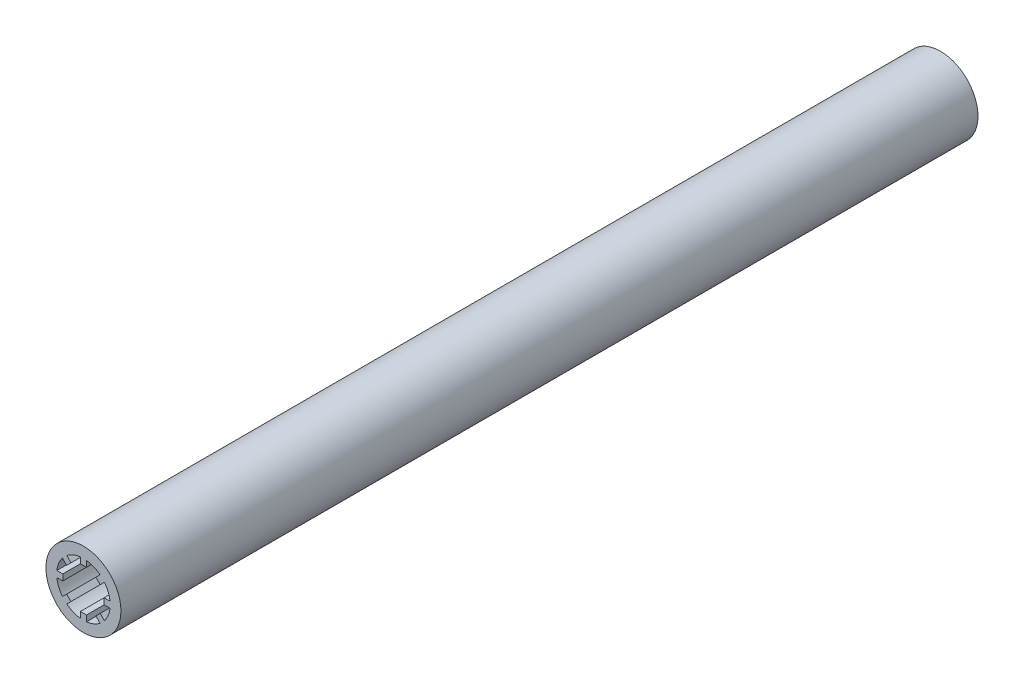
ISO-10303-21;
HEADER;
FILE_DESCRIPTION(('STEP AP214'),'2;1');
FILE_NAME('part.step','',(''),(''),'','','');
FILE_SCHEMA(('AUTOMOTIVE_DESIGN { 1 0 10303 214 1 1 1 1 }'));
ENDSEC;
DATA;
#1=APPLICATION_CONTEXT('core data for automotive mechanical design processes');
#2=APPLICATION_PROTOCOL_DEFINITION('international standard','automotive_design',2000,#1);
#3=PRODUCT_CONTEXT('',#1,'mechanical');
#4=PRODUCT('Part','Part','',(#3));
#5=PRODUCT_RELATED_PRODUCT_CATEGORY('part','',(#4));
#6=PRODUCT_DEFINITION_FORMATION('','',#4);
#7=PRODUCT_DEFINITION_CONTEXT('part definition',#1,'design');
#8=PRODUCT_DEFINITION('design','',#6,#7);
#9=PRODUCT_DEFINITION_SHAPE('','',#8);
#10=(LENGTH_UNIT() NAMED_UNIT(*) SI_UNIT(.MILLI.,.METRE.));
#11=(NAMED_UNIT(*) PLANE_ANGLE_UNIT() SI_UNIT($,.RADIAN.));
#12=(NAMED_UNIT(*) SI_UNIT($,.STERADIAN.) SOLID_ANGLE_UNIT());
#13=UNCERTAINTY_MEASURE_WITH_UNIT(LENGTH_MEASURE(1.E-05),#10,'distance_accuracy_value','');
#14=(GEOMETRIC_REPRESENTATION_CONTEXT(3) GLOBAL_UNCERTAINTY_ASSIGNED_CONTEXT((#13)) GLOBAL_UNIT_ASSIGNED_CONTEXT((#10,
#11,#12)) REPRESENTATION_CONTEXT('',''));
#15=CARTESIAN_POINT('',(0.,0.,0.));
#16=DIRECTION('',(0.,0.,1.));
#17=DIRECTION('',(1.,0.,0.));
#18=AXIS2_PLACEMENT_3D('',#15,#16,#17);
#19=CARTESIAN_POINT('',(0.,0.,280.));
#20=DIRECTION('',(0.,0.,-1.));
#21=DIRECTION('',(-1.,0.,0.));
#22=AXIS2_PLACEMENT_3D('',#19,#20,#21);
#23=CYLINDRICAL_SURFACE('',#22,12.25);
#24=CARTESIAN_POINT('',(0.,0.,280.));
#25=DIRECTION('',(0.,0.,1.));
#26=DIRECTION('',(1.,0.,0.));
#27=AXIS2_PLACEMENT_3D('',#24,#25,#26);
#28=CIRCLE('',#27,12.25);
#29=CARTESIAN_POINT('',(12.25,0.,280.));
#30=VERTEX_POINT('',#29);
#31=EDGE_CURVE('E11',#30,#30,#28,.T.);
#32=ORIENTED_EDGE('',*,*,#31,.F.);
#33=EDGE_LOOP('',(#32));
#34=FACE_BOUND('',#33,.T.);
#35=CARTESIAN_POINT('',(0.,0.,0.));
#36=DIRECTION('',(0.,0.,1.));
#37=DIRECTION('',(1.,0.,0.));
#38=AXIS2_PLACEMENT_3D('',#35,#36,#37);
#39=CIRCLE('',#38,12.25);
#40=CARTESIAN_POINT('',(12.25,0.,0.));
#41=VERTEX_POINT('',#40);
#42=EDGE_CURVE('E36',#41,#41,#39,.T.);
#43=ORIENTED_EDGE('',*,*,#42,.T.);
#44=EDGE_LOOP('',(#43));
#45=FACE_BOUND('',#44,.T.);
#46=ADVANCED_FACE('F33',(#34,#45),#23,.T.);
#47=CARTESIAN_POINT('',(0.,0.,280.));
#48=DIRECTION('',(0.,0.,1.));
#49=DIRECTION('',(1.,0.,0.));
#50=AXIS2_PLACEMENT_3D('',#47,#48,#49);
#51=PLANE('',#50);
#52=DIRECTION('',(0.,-1.,0.));
#53=VECTOR('',#52,1.);
#54=CARTESIAN_POINT('',(1.,8.69266932535686,280.));
#55=LINE('',#54,#53);
#56=CARTESIAN_POINT('',(0.999999999999999,8.69266932535686,280.));
#57=VERTEX_POINT('',#56);
#58=CARTESIAN_POINT('',(1.,6.75000000000049,280.));
#59=VERTEX_POINT('',#58);
#60=EDGE_CURVE('E47',#57,#59,#55,.T.);
#61=ORIENTED_EDGE('',*,*,#60,.F.);
#62=CARTESIAN_POINT('',(0.,0.,280.));
#63=DIRECTION('',(0.,0.,1.));
#64=DIRECTION('',(1.,0.,0.));
#65=AXIS2_PLACEMENT_3D('',#62,#63,#64);
#66=CIRCLE('',#65,8.75);
#67=CARTESIAN_POINT('',(5.43953864538541,6.8537522077588,280.));
#68=VERTEX_POINT('',#67);
#69=EDGE_CURVE('E364',#68,#57,#66,.T.);
#70=ORIENTED_EDGE('',*,*,#69,.F.);
#71=DIRECTION('',(0.707106781186547,0.707106781186548,0.));
#72=VECTOR('',#71,1.);
#73=CARTESIAN_POINT('',(5.43953864538541,6.8537522077588,280.));
#74=LINE('',#73,#72);
#75=CARTESIAN_POINT('',(4.06586399182281,5.48007755419621,280.));
#76=VERTEX_POINT('',#75);
#77=EDGE_CURVE('E362',#76,#68,#74,.T.);
#78=ORIENTED_EDGE('',*,*,#77,.F.);
#79=DIRECTION('',(-0.707106781186547,0.707106781186548,0.));
#80=VECTOR('',#79,1.);
#81=CARTESIAN_POINT('',(5.48007755419606,4.06586399182296,280.));
#82=LINE('',#81,#80);
#83=CARTESIAN_POINT('',(5.48007755419606,4.06586399182296,280.));
#84=VERTEX_POINT('',#83);
#85=EDGE_CURVE('E251',#84,#76,#82,.T.);
#86=ORIENTED_EDGE('',*,*,#85,.F.);
#87=DIRECTION('',(-0.707106781186546,-0.707106781186549,0.));
#88=VECTOR('',#87,1.);
#89=CARTESIAN_POINT('',(6.85375220775867,5.43953864538558,280.));
#90=LINE('',#89,#88);
#91=CARTESIAN_POINT('',(6.85375220775867,5.43953864538558,280.));
#92=VERTEX_POINT('',#91);
#93=EDGE_CURVE('E358',#92,#84,#90,.T.);
#94=ORIENTED_EDGE('',*,*,#93,.F.);
#95=CARTESIAN_POINT('',(0.,0.,280.));
#96=DIRECTION('',(0.,0.,1.));
#97=DIRECTION('',(1.,0.,0.));
#98=AXIS2_PLACEMENT_3D('',#95,#96,#97);
#99=CIRCLE('',#98,8.75);
#100=CARTESIAN_POINT('',(8.69266932535683,1.00000000000021,280.));
#101=VERTEX_POINT('',#100);
#102=EDGE_CURVE('E355',#101,#92,#99,.T.);
#103=ORIENTED_EDGE('',*,*,#102,.F.);
#104=DIRECTION('',(1.,0.,0.));
#105=VECTOR('',#104,1.);
#106=CARTESIAN_POINT('',(8.69266932535683,1.00000000000021,280.));
#107=LINE('',#106,#105);
#108=CARTESIAN_POINT('',(6.75000000000044,1.00000000000021,280.));
#109=VERTEX_POINT('',#108);
#110=EDGE_CURVE('E352',#109,#101,#107,.T.);
#111=ORIENTED_EDGE('',*,*,#110,.F.);
#112=DIRECTION('',(0.,1.,0.));
#113=VECTOR('',#112,1.);
#114=CARTESIAN_POINT('',(6.75000000000044,-1.,280.));
#115=LINE('',#114,#113);
#116=CARTESIAN_POINT('',(6.75000000000044,-1.,280.));
#117=VERTEX_POINT('',#116);
#118=EDGE_CURVE('E349',#117,#109,#115,.T.);
#119=ORIENTED_EDGE('',*,*,#118,.F.);
#120=DIRECTION('',(-1.,0.,0.));
#121=VECTOR('',#120,1.);
#122=CARTESIAN_POINT('',(8.69266932535686,-0.999999999999999,280.));
#123=LINE('',#122,#121);
#124=CARTESIAN_POINT('',(8.69266932535686,-1.,280.));
#125=VERTEX_POINT('',#124);
#126=EDGE_CURVE('E346',#125,#117,#123,.T.);
#127=ORIENTED_EDGE('',*,*,#126,.F.);
#128=CARTESIAN_POINT('',(0.,0.,280.));
#129=DIRECTION('',(0.,0.,1.));
#130=DIRECTION('',(1.,0.,0.));
#131=AXIS2_PLACEMENT_3D('',#128,#129,#130);
#132=CIRCLE('',#131,8.75);
#133=CARTESIAN_POINT('',(6.85375220775881,-5.43953864538541,280.));
#134=VERTEX_POINT('',#133);
#135=EDGE_CURVE('E343',#134,#125,#132,.T.);
#136=ORIENTED_EDGE('',*,*,#135,.F.);
#137=DIRECTION('',(0.707106781186548,-0.707106781186547,0.));
#138=VECTOR('',#137,1.);
#139=CARTESIAN_POINT('',(6.85375220775881,-5.43953864538541,280.));
#140=LINE('',#139,#138);
#141=CARTESIAN_POINT('',(5.48007755419621,-4.06586399182281,280.));
#142=VERTEX_POINT('',#141);
#143=EDGE_CURVE('E340',#142,#134,#140,.T.);
#144=ORIENTED_EDGE('',*,*,#143,.F.);
#145=DIRECTION('',(0.707106781186548,0.707106781186548,0.));
#146=VECTOR('',#145,1.);
#147=CARTESIAN_POINT('',(4.06586399182296,-5.48007755419606,280.));
#148=LINE('',#147,#146);
#149=CARTESIAN_POINT('',(4.06586399182296,-5.48007755419606,280.));
#150=VERTEX_POINT('',#149);
#151=EDGE_CURVE('E337',#150,#142,#148,.T.);
#152=ORIENTED_EDGE('',*,*,#151,.F.);
#153=DIRECTION('',(-0.707106781186549,0.707106781186546,0.));
#154=VECTOR('',#153,1.);
#155=CARTESIAN_POINT('',(5.43953864538558,-6.85375220775867,280.));
#156=LINE('',#155,#154);
#157=CARTESIAN_POINT('',(5.43953864538557,-6.85375220775867,280.));
#158=VERTEX_POINT('',#157);
#159=EDGE_CURVE('E334',#158,#150,#156,.T.);
#160=ORIENTED_EDGE('',*,*,#159,.F.);
#161=CARTESIAN_POINT('',(0.,0.,280.));
#162=DIRECTION('',(0.,0.,1.));
#163=DIRECTION('',(1.,0.,0.));
#164=AXIS2_PLACEMENT_3D('',#161,#162,#163);
#165=CIRCLE('',#164,8.75);
#166=CARTESIAN_POINT('',(1.00000000000021,-8.69266932535683,280.));
#167=VERTEX_POINT('',#166);
#168=EDGE_CURVE('E331',#167,#158,#165,.T.);
#169=ORIENTED_EDGE('',*,*,#168,.F.);
#170=DIRECTION('',(0.,-1.,0.));
#171=VECTOR('',#170,1.);
#172=CARTESIAN_POINT('',(1.00000000000021,-8.69266932535683,280.));
#173=LINE('',#172,#171);
#174=CARTESIAN_POINT('',(1.00000000000021,-6.75000000000044,280.));
#175=VERTEX_POINT('',#174);
#176=EDGE_CURVE('E328',#175,#167,#173,.T.);
#177=ORIENTED_EDGE('',*,*,#176,.F.);
#178=DIRECTION('',(1.,0.,0.));
#179=VECTOR('',#178,1.);
#180=CARTESIAN_POINT('',(-1.,-6.75000000000044,280.));
#181=LINE('',#180,#179);
#182=CARTESIAN_POINT('',(-1.,-6.75000000000044,280.));
#183=VERTEX_POINT('',#182);
#184=EDGE_CURVE('E325',#183,#175,#181,.T.);
#185=ORIENTED_EDGE('',*,*,#184,.F.);
#186=DIRECTION('',(0.,1.,0.));
#187=VECTOR('',#186,1.);
#188=CARTESIAN_POINT('',(-0.999999999999999,-8.69266932535686,280.));
#189=LINE('',#188,#187);
#190=CARTESIAN_POINT('',(-1.,-8.69266932535686,280.));
#191=VERTEX_POINT('',#190);
#192=EDGE_CURVE('E322',#191,#183,#189,.T.);
#193=ORIENTED_EDGE('',*,*,#192,.F.);
#194=CARTESIAN_POINT('',(0.,0.,280.));
#195=DIRECTION('',(0.,0.,1.));
#196=DIRECTION('',(1.,0.,0.));
#197=AXIS2_PLACEMENT_3D('',#194,#195,#196);
#198=CIRCLE('',#197,8.75);
#199=CARTESIAN_POINT('',(-5.43953864538541,-6.85375220775881,280.));
#200=VERTEX_POINT('',#199);
#201=EDGE_CURVE('E319',#200,#191,#198,.T.);
#202=ORIENTED_EDGE('',*,*,#201,.F.);
#203=DIRECTION('',(-0.707106781186547,-0.707106781186548,0.));
#204=VECTOR('',#203,1.);
#205=CARTESIAN_POINT('',(-5.43953864538541,-6.85375220775881,280.));
#206=LINE('',#205,#204);
#207=CARTESIAN_POINT('',(-4.06586399182281,-5.48007755419621,280.));
#208=VERTEX_POINT('',#207);
#209=EDGE_CURVE('E316',#208,#200,#206,.T.);
#210=ORIENTED_EDGE('',*,*,#209,.F.);
#211=DIRECTION('',(0.707106781186547,-0.707106781186548,0.));
#212=VECTOR('',#211,1.);
#213=CARTESIAN_POINT('',(-5.48007755419606,-4.06586399182296,280.));
#214=LINE('',#213,#212);
#215=CARTESIAN_POINT('',(-5.48007755419606,-4.06586399182296,280.));
#216=VERTEX_POINT('',#215);
#217=EDGE_CURVE('E313',#216,#208,#214,.T.);
#218=ORIENTED_EDGE('',*,*,#217,.F.);
#219=DIRECTION('',(0.707106781186546,0.707106781186549,0.));
#220=VECTOR('',#219,1.);
#221=CARTESIAN_POINT('',(-6.85375220775867,-5.43953864538558,280.));
#222=LINE('',#221,#220);
#223=CARTESIAN_POINT('',(-6.85375220775867,-5.43953864538558,280.));
#224=VERTEX_POINT('',#223);
#225=EDGE_CURVE('E310',#224,#216,#222,.T.);
#226=ORIENTED_EDGE('',*,*,#225,.F.);
#227=CARTESIAN_POINT('',(0.,0.,280.));
#228=DIRECTION('',(0.,0.,1.));
#229=DIRECTION('',(1.,0.,0.));
#230=AXIS2_PLACEMENT_3D('',#227,#228,#229);
#231=CIRCLE('',#230,8.75);
#232=CARTESIAN_POINT('',(-8.69266932535683,-1.00000000000021,280.));
#233=VERTEX_POINT('',#232);
#234=EDGE_CURVE('E307',#233,#224,#231,.T.);
#235=ORIENTED_EDGE('',*,*,#234,.F.);
#236=DIRECTION('',(-1.,0.,0.));
#237=VECTOR('',#236,1.);
#238=CARTESIAN_POINT('',(-8.69266932535683,-1.00000000000021,280.));
#239=LINE('',#238,#237);
#240=CARTESIAN_POINT('',(-6.75000000000044,-1.00000000000021,280.));
#241=VERTEX_POINT('',#240);
#242=EDGE_CURVE('E304',#241,#233,#239,.T.);
#243=ORIENTED_EDGE('',*,*,#242,.F.);
#244=DIRECTION('',(0.,-1.,0.));
#245=VECTOR('',#244,1.);
#246=CARTESIAN_POINT('',(-6.75000000000044,1.,280.));
#247=LINE('',#246,#245);
#248=CARTESIAN_POINT('',(-6.75000000000044,1.,280.));
#249=VERTEX_POINT('',#248);
#250=EDGE_CURVE('E301',#249,#241,#247,.T.);
#251=ORIENTED_EDGE('',*,*,#250,.F.);
#252=DIRECTION('',(1.,0.,0.));
#253=VECTOR('',#252,1.);
#254=CARTESIAN_POINT('',(-8.69266932535686,0.999999999999998,280.));
#255=LINE('',#254,#253);
#256=CARTESIAN_POINT('',(-8.69266932535686,0.999999999999999,280.));
#257=VERTEX_POINT('',#256);
#258=EDGE_CURVE('E298',#257,#249,#255,.T.);
#259=ORIENTED_EDGE('',*,*,#258,.F.);
#260=CARTESIAN_POINT('',(0.,0.,280.));
#261=DIRECTION('',(0.,0.,1.));
#262=DIRECTION('',(1.,0.,0.));
#263=AXIS2_PLACEMENT_3D('',#260,#261,#262);
#264=CIRCLE('',#263,8.75);
#265=CARTESIAN_POINT('',(-6.85375220775881,5.43953864538541,280.));
#266=VERTEX_POINT('',#265);
#267=EDGE_CURVE('E295',#266,#257,#264,.T.);
#268=ORIENTED_EDGE('',*,*,#267,.F.);
#269=DIRECTION('',(-0.707106781186548,0.707106781186547,0.));
#270=VECTOR('',#269,1.);
#271=CARTESIAN_POINT('',(-6.85375220775881,5.43953864538541,280.));
#272=LINE('',#271,#270);
#273=CARTESIAN_POINT('',(-5.48007755419621,4.06586399182281,280.));
#274=VERTEX_POINT('',#273);
#275=EDGE_CURVE('E292',#274,#266,#272,.T.);
#276=ORIENTED_EDGE('',*,*,#275,.F.);
#277=DIRECTION('',(-0.707106781186548,-0.707106781186548,0.));
#278=VECTOR('',#277,1.);
#279=CARTESIAN_POINT('',(-4.06586399182296,5.48007755419606,280.));
#280=LINE('',#279,#278);
#281=CARTESIAN_POINT('',(-4.06586399182296,5.48007755419606,280.));
#282=VERTEX_POINT('',#281);
#283=EDGE_CURVE('E289',#282,#274,#280,.T.);
#284=ORIENTED_EDGE('',*,*,#283,.F.);
#285=DIRECTION('',(0.707106781186549,-0.707106781186546,0.));
#286=VECTOR('',#285,1.);
#287=CARTESIAN_POINT('',(-5.43953864538558,6.85375220775867,280.));
#288=LINE('',#287,#286);
#289=CARTESIAN_POINT('',(-5.43953864538558,6.85375220775867,280.));
#290=VERTEX_POINT('',#289);
#291=EDGE_CURVE('E286',#290,#282,#288,.T.);
#292=ORIENTED_EDGE('',*,*,#291,.F.);
#293=CARTESIAN_POINT('',(0.,0.,280.));
#294=DIRECTION('',(0.,0.,1.));
#295=DIRECTION('',(1.,0.,0.));
#296=AXIS2_PLACEMENT_3D('',#293,#294,#295);
#297=CIRCLE('',#296,8.75);
#298=CARTESIAN_POINT('',(-1.00000000000021,8.69266932535683,280.));
#299=VERTEX_POINT('',#298);
#300=EDGE_CURVE('E283',#299,#290,#297,.T.);
#301=ORIENTED_EDGE('',*,*,#300,.F.);
#302=DIRECTION('',(0.,1.,0.));
#303=VECTOR('',#302,1.);
#304=CARTESIAN_POINT('',(-1.00000000000021,8.69266932535683,280.));
#305=LINE('',#304,#303);
#306=CARTESIAN_POINT('',(-1.00000000000021,6.75000000000044,280.));
#307=VERTEX_POINT('',#306);
#308=EDGE_CURVE('E280',#307,#299,#305,.T.);
#309=ORIENTED_EDGE('',*,*,#308,.F.);
#310=DIRECTION('',(-1.,0.,0.));
#311=VECTOR('',#310,1.);
#312=CARTESIAN_POINT('',(1.,6.75000000000049,280.));
#313=LINE('',#312,#311);
#314=EDGE_CURVE('E277',#59,#307,#313,.T.);
#315=ORIENTED_EDGE('',*,*,#314,.F.);
#316=EDGE_LOOP('',(#61,#70,#78,#86,#94,#103,#111,#119,#127,#136,#144,#152,#160,#169,#177,#185,
#193,#202,#210,#218,#226,#235,#243,#251,#259,#268,#276,#284,#292,#301,#309,#315));
#317=FACE_BOUND('',#316,.T.);
#318=ORIENTED_EDGE('',*,*,#31,.T.);
#319=EDGE_LOOP('',(#318));
#320=FACE_BOUND('',#319,.T.);
#321=ADVANCED_FACE('F431',(#317,#320),#51,.T.);
#322=CARTESIAN_POINT('',(0.,0.,0.));
#323=DIRECTION('',(0.,0.,1.));
#324=DIRECTION('',(1.,0.,0.));
#325=AXIS2_PLACEMENT_3D('',#322,#323,#324);
#326=PLANE('',#325);
#327=ORIENTED_EDGE('',*,*,#42,.F.);
#328=EDGE_LOOP('',(#327));
#329=FACE_BOUND('',#328,.T.);
#330=ADVANCED_FACE('F534',(#329),#326,.F.);
#331=CARTESIAN_POINT('',(1.,8.69266932535686,260.));
#332=DIRECTION('',(-1.,0.,0.));
#333=DIRECTION('',(0.,-1.,0.));
#334=AXIS2_PLACEMENT_3D('',#331,#332,#333);
#335=PLANE('',#334);
#336=ORIENTED_EDGE('',*,*,#60,.T.);
#337=DIRECTION('',(0.,0.,1.));
#338=VECTOR('',#337,1.);
#339=CARTESIAN_POINT('',(1.,6.75000000000049,260.));
#340=LINE('',#339,#338);
#341=CARTESIAN_POINT('',(1.,6.75000000000049,260.));
#342=VERTEX_POINT('',#341);
#343=EDGE_CURVE('E155',#342,#59,#340,.T.);
#344=ORIENTED_EDGE('',*,*,#343,.F.);
#345=DIRECTION('',(0.,-1.,0.));
#346=VECTOR('',#345,1.);
#347=CARTESIAN_POINT('',(1.,8.69266932535686,260.));
#348=LINE('',#347,#346);
#349=CARTESIAN_POINT('',(0.999999999999999,8.69266932535686,260.));
#350=VERTEX_POINT('',#349);
#351=EDGE_CURVE('E366',#350,#342,#348,.T.);
#352=ORIENTED_EDGE('',*,*,#351,.F.);
#353=DIRECTION('',(0.,0.,1.));
#354=VECTOR('',#353,1.);
#355=CARTESIAN_POINT('',(0.999999999999999,8.69266932535686,260.));
#356=LINE('',#355,#354);
#357=EDGE_CURVE('E55',#350,#57,#356,.T.);
#358=ORIENTED_EDGE('',*,*,#357,.T.);
#359=EDGE_LOOP('',(#336,#344,#352,#358));
#360=FACE_BOUND('',#359,.T.);
#361=ADVANCED_FACE('F527',(#360),#335,.F.);
#362=CARTESIAN_POINT('',(0.,0.,260.));
#363=DIRECTION('',(0.,0.,1.));
#364=DIRECTION('',(1.,0.,0.));
#365=AXIS2_PLACEMENT_3D('',#362,#363,#364);
#366=CYLINDRICAL_SURFACE('',#365,8.75);
#367=ORIENTED_EDGE('',*,*,#69,.T.);
#368=ORIENTED_EDGE('',*,*,#357,.F.);
#369=CARTESIAN_POINT('',(0.,0.,260.));
#370=DIRECTION('',(0.,0.,1.));
#371=DIRECTION('',(1.,0.,0.));
#372=AXIS2_PLACEMENT_3D('',#369,#370,#371);
#373=CIRCLE('',#372,8.75);
#374=CARTESIAN_POINT('',(5.43953864538541,6.8537522077588,260.));
#375=VERTEX_POINT('',#374);
#376=EDGE_CURVE('E263',#375,#350,#373,.T.);
#377=ORIENTED_EDGE('',*,*,#376,.F.);
#378=DIRECTION('',(0.,0.,1.));
#379=VECTOR('',#378,1.);
#380=CARTESIAN_POINT('',(5.43953864538541,6.8537522077588,260.));
#381=LINE('',#380,#379);
#382=EDGE_CURVE('E255',#375,#68,#381,.T.);
#383=ORIENTED_EDGE('',*,*,#382,.T.);
#384=EDGE_LOOP('',(#367,#368,#377,#383));
#385=FACE_BOUND('',#384,.T.);
#386=ADVANCED_FACE('F525',(#385),#366,.F.);
#387=CARTESIAN_POINT('',(5.43953864538541,6.8537522077588,260.));
#388=DIRECTION('',(0.707106781186548,-0.707106781186547,0.));
#389=DIRECTION('',(0.707106781186547,0.707106781186548,0.));
#390=AXIS2_PLACEMENT_3D('',#387,#388,#389);
#391=PLANE('',#390);
#392=ORIENTED_EDGE('',*,*,#77,.T.);
#393=ORIENTED_EDGE('',*,*,#382,.F.);
#394=DIRECTION('',(0.707106781186547,0.707106781186548,0.));
#395=VECTOR('',#394,1.);
#396=CARTESIAN_POINT('',(5.43953864538541,6.8537522077588,260.));
#397=LINE('',#396,#395);
#398=CARTESIAN_POINT('',(4.06586399182281,5.48007755419621,260.));
#399=VERTEX_POINT('',#398);
#400=EDGE_CURVE('E259',#399,#375,#397,.T.);
#401=ORIENTED_EDGE('',*,*,#400,.F.);
#402=DIRECTION('',(0.,0.,1.));
#403=VECTOR('',#402,1.);
#404=CARTESIAN_POINT('',(4.06586399182281,5.48007755419621,260.));
#405=LINE('',#404,#403);
#406=EDGE_CURVE('E244',#399,#76,#405,.T.);
#407=ORIENTED_EDGE('',*,*,#406,.T.);
#408=EDGE_LOOP('',(#392,#393,#401,#407));
#409=FACE_BOUND('',#408,.T.);
#410=ADVANCED_FACE('F260',(#409),#391,.F.);
#411=CARTESIAN_POINT('',(5.48007755419606,4.06586399182296,260.));
#412=DIRECTION('',(0.707106781186548,0.707106781186547,0.));
#413=DIRECTION('',(-0.707106781186547,0.707106781186548,0.));
#414=AXIS2_PLACEMENT_3D('',#411,#412,#413);
#415=PLANE('',#414);
#416=ORIENTED_EDGE('',*,*,#85,.T.);
#417=ORIENTED_EDGE('',*,*,#406,.F.);
#418=DIRECTION('',(-0.707106781186547,0.707106781186548,0.));
#419=VECTOR('',#418,1.);
#420=CARTESIAN_POINT('',(5.48007755419606,4.06586399182296,260.));
#421=LINE('',#420,#419);
#422=CARTESIAN_POINT('',(5.48007755419606,4.06586399182296,260.));
#423=VERTEX_POINT('',#422);
#424=EDGE_CURVE('E248',#423,#399,#421,.T.);
#425=ORIENTED_EDGE('',*,*,#424,.F.);
#426=DIRECTION('',(0.,0.,1.));
#427=VECTOR('',#426,1.);
#428=CARTESIAN_POINT('',(5.48007755419606,4.06586399182296,260.));
#429=LINE('',#428,#427);
#430=EDGE_CURVE('E256',#423,#84,#429,.T.);
#431=ORIENTED_EDGE('',*,*,#430,.T.);
#432=EDGE_LOOP('',(#416,#417,#425,#431));
#433=FACE_BOUND('',#432,.T.);
#434=ADVANCED_FACE('F246',(#433),#415,.F.);
#435=CARTESIAN_POINT('',(6.85375220775867,5.43953864538558,260.));
#436=DIRECTION('',(-0.707106781186549,0.707106781186546,0.));
#437=DIRECTION('',(-0.707106781186546,-0.707106781186549,0.));
#438=AXIS2_PLACEMENT_3D('',#435,#436,#437);
#439=PLANE('',#438);
#440=ORIENTED_EDGE('',*,*,#93,.T.);
#441=ORIENTED_EDGE('',*,*,#430,.F.);
#442=DIRECTION('',(-0.707106781186546,-0.707106781186549,0.));
#443=VECTOR('',#442,1.);
#444=CARTESIAN_POINT('',(6.85375220775867,5.43953864538558,260.));
#445=LINE('',#444,#443);
#446=CARTESIAN_POINT('',(6.85375220775867,5.43953864538558,260.));
#447=VERTEX_POINT('',#446);
#448=EDGE_CURVE('E269',#447,#423,#445,.T.);
#449=ORIENTED_EDGE('',*,*,#448,.F.);
#450=DIRECTION('',(0.,0.,1.));
#451=VECTOR('',#450,1.);
#452=CARTESIAN_POINT('',(6.85375220775867,5.43953864538558,260.));
#453=LINE('',#452,#451);
#454=EDGE_CURVE('E370',#447,#92,#453,.T.);
#455=ORIENTED_EDGE('',*,*,#454,.T.);
#456=EDGE_LOOP('',(#440,#441,#449,#455));
#457=FACE_BOUND('',#456,.T.);
#458=ADVANCED_FACE('F524',(#457),#439,.F.);
#459=CARTESIAN_POINT('',(0.,0.,260.));
#460=DIRECTION('',(0.,0.,1.));
#461=DIRECTION('',(1.,0.,0.));
#462=AXIS2_PLACEMENT_3D('',#459,#460,#461);
#463=CYLINDRICAL_SURFACE('',#462,8.75);
#464=ORIENTED_EDGE('',*,*,#102,.T.);
#465=ORIENTED_EDGE('',*,*,#454,.F.);
#466=CARTESIAN_POINT('',(0.,0.,260.));
#467=DIRECTION('',(0.,0.,1.));
#468=DIRECTION('',(1.,0.,0.));
#469=AXIS2_PLACEMENT_3D('',#466,#467,#468);
#470=CIRCLE('',#469,8.75);
#471=CARTESIAN_POINT('',(8.69266932535683,1.00000000000021,260.));
#472=VERTEX_POINT('',#471);
#473=EDGE_CURVE('E271',#472,#447,#470,.T.);
#474=ORIENTED_EDGE('',*,*,#473,.F.);
#475=DIRECTION('',(0.,0.,1.));
#476=VECTOR('',#475,1.);
#477=CARTESIAN_POINT('',(8.69266932535683,1.00000000000021,260.));
#478=LINE('',#477,#476);
#479=EDGE_CURVE('E372',#472,#101,#478,.T.);
#480=ORIENTED_EDGE('',*,*,#479,.T.);
#481=EDGE_LOOP('',(#464,#465,#474,#480));
#482=FACE_BOUND('',#481,.T.);
#483=ADVANCED_FACE('F520',(#482),#463,.F.);
#484=CARTESIAN_POINT('',(8.69266932535683,1.00000000000021,260.));
#485=DIRECTION('',(0.,-1.,0.));
#486=DIRECTION('',(1.,0.,0.));
#487=AXIS2_PLACEMENT_3D('',#484,#485,#486);
#488=PLANE('',#487);
#489=ORIENTED_EDGE('',*,*,#110,.T.);
#490=ORIENTED_EDGE('',*,*,#479,.F.);
#491=DIRECTION('',(1.,0.,0.));
#492=VECTOR('',#491,1.);
#493=CARTESIAN_POINT('',(8.69266932535683,1.00000000000021,260.));
#494=LINE('',#493,#492);
#495=CARTESIAN_POINT('',(6.75000000000044,1.00000000000021,260.));
#496=VERTEX_POINT('',#495);
#497=EDGE_CURVE('E515',#496,#472,#494,.T.);
#498=ORIENTED_EDGE('',*,*,#497,.F.);
#499=DIRECTION('',(0.,0.,1.));
#500=VECTOR('',#499,1.);
#501=CARTESIAN_POINT('',(6.75000000000044,1.00000000000021,260.));
#502=LINE('',#501,#500);
#503=EDGE_CURVE('E374',#496,#109,#502,.T.);
#504=ORIENTED_EDGE('',*,*,#503,.T.);
#505=EDGE_LOOP('',(#489,#490,#498,#504));
#506=FACE_BOUND('',#505,.T.);
#507=ADVANCED_FACE('F647',(#506),#488,.F.);
#508=CARTESIAN_POINT('',(6.75000000000044,-1.,260.));
#509=DIRECTION('',(1.,0.,0.));
#510=DIRECTION('',(0.,1.,0.));
#511=AXIS2_PLACEMENT_3D('',#508,#509,#510);
#512=PLANE('',#511);
#513=ORIENTED_EDGE('',*,*,#118,.T.);
#514=ORIENTED_EDGE('',*,*,#503,.F.);
#515=DIRECTION('',(0.,1.,0.));
#516=VECTOR('',#515,1.);
#517=CARTESIAN_POINT('',(6.75000000000044,-1.,260.));
#518=LINE('',#517,#516);
#519=CARTESIAN_POINT('',(6.75000000000044,-1.,260.));
#520=VERTEX_POINT('',#519);
#521=EDGE_CURVE('E512',#520,#496,#518,.T.);
#522=ORIENTED_EDGE('',*,*,#521,.F.);
#523=DIRECTION('',(0.,0.,1.));
#524=VECTOR('',#523,1.);
#525=CARTESIAN_POINT('',(6.75000000000044,-1.,260.));
#526=LINE('',#525,#524);
#527=EDGE_CURVE('E376',#520,#117,#526,.T.);
#528=ORIENTED_EDGE('',*,*,#527,.T.);
#529=EDGE_LOOP('',(#513,#514,#522,#528));
#530=FACE_BOUND('',#529,.T.);
#531=ADVANCED_FACE('F643',(#530),#512,.F.);
#532=CARTESIAN_POINT('',(8.69266932535686,-0.999999999999999,260.));
#533=DIRECTION('',(0.,1.,0.));
#534=DIRECTION('',(-1.,0.,0.));
#535=AXIS2_PLACEMENT_3D('',#532,#533,#534);
#536=PLANE('',#535);
#537=ORIENTED_EDGE('',*,*,#126,.T.);
#538=ORIENTED_EDGE('',*,*,#527,.F.);
#539=DIRECTION('',(-1.,0.,0.));
#540=VECTOR('',#539,1.);
#541=CARTESIAN_POINT('',(8.69266932535686,-0.999999999999999,260.));
#542=LINE('',#541,#540);
#543=CARTESIAN_POINT('',(8.69266932535686,-1.,260.));
#544=VERTEX_POINT('',#543);
#545=EDGE_CURVE('E509',#544,#520,#542,.T.);
#546=ORIENTED_EDGE('',*,*,#545,.F.);
#547=DIRECTION('',(0.,0.,1.));
#548=VECTOR('',#547,1.);
#549=CARTESIAN_POINT('',(8.69266932535686,-1.,260.));
#550=LINE('',#549,#548);
#551=EDGE_CURVE('E378',#544,#125,#550,.T.);
#552=ORIENTED_EDGE('',*,*,#551,.T.);
#553=EDGE_LOOP('',(#537,#538,#546,#552));
#554=FACE_BOUND('',#553,.T.);
#555=ADVANCED_FACE('F639',(#554),#536,.F.);
#556=CARTESIAN_POINT('',(0.,0.,260.));
#557=DIRECTION('',(0.,0.,1.));
#558=DIRECTION('',(1.,0.,0.));
#559=AXIS2_PLACEMENT_3D('',#556,#557,#558);
#560=CYLINDRICAL_SURFACE('',#559,8.75);
#561=ORIENTED_EDGE('',*,*,#135,.T.);
#562=ORIENTED_EDGE('',*,*,#551,.F.);
#563=CARTESIAN_POINT('',(0.,0.,260.));
#564=DIRECTION('',(0.,0.,1.));
#565=DIRECTION('',(1.,0.,0.));
#566=AXIS2_PLACEMENT_3D('',#563,#564,#565);
#567=CIRCLE('',#566,8.75);
#568=CARTESIAN_POINT('',(6.85375220775881,-5.43953864538541,260.));
#569=VERTEX_POINT('',#568);
#570=EDGE_CURVE('E506',#569,#544,#567,.T.);
#571=ORIENTED_EDGE('',*,*,#570,.F.);
#572=DIRECTION('',(0.,0.,1.));
#573=VECTOR('',#572,1.);
#574=CARTESIAN_POINT('',(6.85375220775881,-5.43953864538541,260.));
#575=LINE('',#574,#573);
#576=EDGE_CURVE('E380',#569,#134,#575,.T.);
#577=ORIENTED_EDGE('',*,*,#576,.T.);
#578=EDGE_LOOP('',(#561,#562,#571,#577));
#579=FACE_BOUND('',#578,.T.);
#580=ADVANCED_FACE('F635',(#579),#560,.F.);
#581=CARTESIAN_POINT('',(6.85375220775881,-5.43953864538541,260.));
#582=DIRECTION('',(-0.707106781186547,-0.707106781186548,0.));
#583=DIRECTION('',(0.707106781186548,-0.707106781186547,0.));
#584=AXIS2_PLACEMENT_3D('',#581,#582,#583);
#585=PLANE('',#584);
#586=ORIENTED_EDGE('',*,*,#143,.T.);
#587=ORIENTED_EDGE('',*,*,#576,.F.);
#588=DIRECTION('',(0.707106781186548,-0.707106781186547,0.));
#589=VECTOR('',#588,1.);
#590=CARTESIAN_POINT('',(6.85375220775881,-5.43953864538541,260.));
#591=LINE('',#590,#589);
#592=CARTESIAN_POINT('',(5.48007755419621,-4.06586399182281,260.));
#593=VERTEX_POINT('',#592);
#594=EDGE_CURVE('E503',#593,#569,#591,.T.);
#595=ORIENTED_EDGE('',*,*,#594,.F.);
#596=DIRECTION('',(0.,0.,1.));
#597=VECTOR('',#596,1.);
#598=CARTESIAN_POINT('',(5.48007755419621,-4.06586399182281,260.));
#599=LINE('',#598,#597);
#600=EDGE_CURVE('E382',#593,#142,#599,.T.);
#601=ORIENTED_EDGE('',*,*,#600,.T.);
#602=EDGE_LOOP('',(#586,#587,#595,#601));
#603=FACE_BOUND('',#602,.T.);
#604=ADVANCED_FACE('F631',(#603),#585,.F.);
#605=CARTESIAN_POINT('',(4.06586399182296,-5.48007755419606,260.));
#606=DIRECTION('',(0.707106781186548,-0.707106781186548,0.));
#607=DIRECTION('',(0.707106781186548,0.707106781186548,0.));
#608=AXIS2_PLACEMENT_3D('',#605,#606,#607);
#609=PLANE('',#608);
#610=ORIENTED_EDGE('',*,*,#151,.T.);
#611=ORIENTED_EDGE('',*,*,#600,.F.);
#612=DIRECTION('',(0.707106781186548,0.707106781186548,0.));
#613=VECTOR('',#612,1.);
#614=CARTESIAN_POINT('',(4.06586399182296,-5.48007755419606,260.));
#615=LINE('',#614,#613);
#616=CARTESIAN_POINT('',(4.06586399182296,-5.48007755419606,260.));
#617=VERTEX_POINT('',#616);
#618=EDGE_CURVE('E500',#617,#593,#615,.T.);
#619=ORIENTED_EDGE('',*,*,#618,.F.);
#620=DIRECTION('',(0.,0.,1.));
#621=VECTOR('',#620,1.);
#622=CARTESIAN_POINT('',(4.06586399182296,-5.48007755419606,260.));
#623=LINE('',#622,#621);
#624=EDGE_CURVE('E384',#617,#150,#623,.T.);
#625=ORIENTED_EDGE('',*,*,#624,.T.);
#626=EDGE_LOOP('',(#610,#611,#619,#625));
#627=FACE_BOUND('',#626,.T.);
#628=ADVANCED_FACE('F627',(#627),#609,.F.);
#629=CARTESIAN_POINT('',(5.43953864538558,-6.85375220775867,260.));
#630=DIRECTION('',(0.707106781186546,0.707106781186549,0.));
#631=DIRECTION('',(-0.707106781186549,0.707106781186546,0.));
#632=AXIS2_PLACEMENT_3D('',#629,#630,#631);
#633=PLANE('',#632);
#634=ORIENTED_EDGE('',*,*,#159,.T.);
#635=ORIENTED_EDGE('',*,*,#624,.F.);
#636=DIRECTION('',(-0.707106781186549,0.707106781186546,0.));
#637=VECTOR('',#636,1.);
#638=CARTESIAN_POINT('',(5.43953864538558,-6.85375220775867,260.));
#639=LINE('',#638,#637);
#640=CARTESIAN_POINT('',(5.43953864538557,-6.85375220775867,260.));
#641=VERTEX_POINT('',#640);
#642=EDGE_CURVE('E497',#641,#617,#639,.T.);
#643=ORIENTED_EDGE('',*,*,#642,.F.);
#644=DIRECTION('',(0.,0.,1.));
#645=VECTOR('',#644,1.);
#646=CARTESIAN_POINT('',(5.43953864538557,-6.85375220775867,260.));
#647=LINE('',#646,#645);
#648=EDGE_CURVE('E386',#641,#158,#647,.T.);
#649=ORIENTED_EDGE('',*,*,#648,.T.);
#650=EDGE_LOOP('',(#634,#635,#643,#649));
#651=FACE_BOUND('',#650,.T.);
#652=ADVANCED_FACE('F623',(#651),#633,.F.);
#653=CARTESIAN_POINT('',(0.,0.,260.));
#654=DIRECTION('',(0.,0.,1.));
#655=DIRECTION('',(1.,0.,0.));
#656=AXIS2_PLACEMENT_3D('',#653,#654,#655);
#657=CYLINDRICAL_SURFACE('',#656,8.75);
#658=ORIENTED_EDGE('',*,*,#168,.T.);
#659=ORIENTED_EDGE('',*,*,#648,.F.);
#660=CARTESIAN_POINT('',(0.,0.,260.));
#661=DIRECTION('',(0.,0.,1.));
#662=DIRECTION('',(1.,0.,0.));
#663=AXIS2_PLACEMENT_3D('',#660,#661,#662);
#664=CIRCLE('',#663,8.75);
#665=CARTESIAN_POINT('',(1.00000000000021,-8.69266932535683,260.));
#666=VERTEX_POINT('',#665);
#667=EDGE_CURVE('E494',#666,#641,#664,.T.);
#668=ORIENTED_EDGE('',*,*,#667,.F.);
#669=DIRECTION('',(0.,0.,1.));
#670=VECTOR('',#669,1.);
#671=CARTESIAN_POINT('',(1.00000000000021,-8.69266932535683,260.));
#672=LINE('',#671,#670);
#673=EDGE_CURVE('E388',#666,#167,#672,.T.);
#674=ORIENTED_EDGE('',*,*,#673,.T.);
#675=EDGE_LOOP('',(#658,#659,#668,#674));
#676=FACE_BOUND('',#675,.T.);
#677=ADVANCED_FACE('F619',(#676),#657,.F.);
#678=CARTESIAN_POINT('',(1.00000000000021,-8.69266932535683,260.));
#679=DIRECTION('',(-1.,0.,0.));
#680=DIRECTION('',(0.,-1.,0.));
#681=AXIS2_PLACEMENT_3D('',#678,#679,#680);
#682=PLANE('',#681);
#683=ORIENTED_EDGE('',*,*,#176,.T.);
#684=ORIENTED_EDGE('',*,*,#673,.F.);
#685=DIRECTION('',(0.,-1.,0.));
#686=VECTOR('',#685,1.);
#687=CARTESIAN_POINT('',(1.00000000000021,-8.69266932535683,260.));
#688=LINE('',#687,#686);
#689=CARTESIAN_POINT('',(1.00000000000021,-6.75000000000044,260.));
#690=VERTEX_POINT('',#689);
#691=EDGE_CURVE('E491',#690,#666,#688,.T.);
#692=ORIENTED_EDGE('',*,*,#691,.F.);
#693=DIRECTION('',(0.,0.,1.));
#694=VECTOR('',#693,1.);
#695=CARTESIAN_POINT('',(1.00000000000021,-6.75000000000044,260.));
#696=LINE('',#695,#694);
#697=EDGE_CURVE('E390',#690,#175,#696,.T.);
#698=ORIENTED_EDGE('',*,*,#697,.T.);
#699=EDGE_LOOP('',(#683,#684,#692,#698));
#700=FACE_BOUND('',#699,.T.);
#701=ADVANCED_FACE('F615',(#700),#682,.F.);
#702=CARTESIAN_POINT('',(-1.,-6.75000000000044,260.));
#703=DIRECTION('',(0.,-1.,0.));
#704=DIRECTION('',(1.,0.,0.));
#705=AXIS2_PLACEMENT_3D('',#702,#703,#704);
#706=PLANE('',#705);
#707=ORIENTED_EDGE('',*,*,#184,.T.);
#708=ORIENTED_EDGE('',*,*,#697,.F.);
#709=DIRECTION('',(1.,0.,0.));
#710=VECTOR('',#709,1.);
#711=CARTESIAN_POINT('',(-1.,-6.75000000000044,260.));
#712=LINE('',#711,#710);
#713=CARTESIAN_POINT('',(-1.,-6.75000000000044,260.));
#714=VERTEX_POINT('',#713);
#715=EDGE_CURVE('E488',#714,#690,#712,.T.);
#716=ORIENTED_EDGE('',*,*,#715,.F.);
#717=DIRECTION('',(0.,0.,1.));
#718=VECTOR('',#717,1.);
#719=CARTESIAN_POINT('',(-1.,-6.75000000000044,260.));
#720=LINE('',#719,#718);
#721=EDGE_CURVE('E392',#714,#183,#720,.T.);
#722=ORIENTED_EDGE('',*,*,#721,.T.);
#723=EDGE_LOOP('',(#707,#708,#716,#722));
#724=FACE_BOUND('',#723,.T.);
#725=ADVANCED_FACE('F611',(#724),#706,.F.);
#726=CARTESIAN_POINT('',(-0.999999999999999,-8.69266932535686,260.));
#727=DIRECTION('',(1.,0.,0.));
#728=DIRECTION('',(0.,1.,0.));
#729=AXIS2_PLACEMENT_3D('',#726,#727,#728);
#730=PLANE('',#729);
#731=ORIENTED_EDGE('',*,*,#192,.T.);
#732=ORIENTED_EDGE('',*,*,#721,.F.);
#733=DIRECTION('',(0.,1.,0.));
#734=VECTOR('',#733,1.);
#735=CARTESIAN_POINT('',(-0.999999999999999,-8.69266932535686,260.));
#736=LINE('',#735,#734);
#737=CARTESIAN_POINT('',(-1.,-8.69266932535686,260.));
#738=VERTEX_POINT('',#737);
#739=EDGE_CURVE('E485',#738,#714,#736,.T.);
#740=ORIENTED_EDGE('',*,*,#739,.F.);
#741=DIRECTION('',(0.,0.,1.));
#742=VECTOR('',#741,1.);
#743=CARTESIAN_POINT('',(-1.,-8.69266932535686,260.));
#744=LINE('',#743,#742);
#745=EDGE_CURVE('E394',#738,#191,#744,.T.);
#746=ORIENTED_EDGE('',*,*,#745,.T.);
#747=EDGE_LOOP('',(#731,#732,#740,#746));
#748=FACE_BOUND('',#747,.T.);
#749=ADVANCED_FACE('F607',(#748),#730,.F.);
#750=CARTESIAN_POINT('',(0.,0.,260.));
#751=DIRECTION('',(0.,0.,1.));
#752=DIRECTION('',(1.,0.,0.));
#753=AXIS2_PLACEMENT_3D('',#750,#751,#752);
#754=CYLINDRICAL_SURFACE('',#753,8.75);
#755=ORIENTED_EDGE('',*,*,#201,.T.);
#756=ORIENTED_EDGE('',*,*,#745,.F.);
#757=CARTESIAN_POINT('',(0.,0.,260.));
#758=DIRECTION('',(0.,0.,1.));
#759=DIRECTION('',(1.,0.,0.));
#760=AXIS2_PLACEMENT_3D('',#757,#758,#759);
#761=CIRCLE('',#760,8.75);
#762=CARTESIAN_POINT('',(-5.43953864538541,-6.85375220775881,260.));
#763=VERTEX_POINT('',#762);
#764=EDGE_CURVE('E482',#763,#738,#761,.T.);
#765=ORIENTED_EDGE('',*,*,#764,.F.);
#766=DIRECTION('',(0.,0.,1.));
#767=VECTOR('',#766,1.);
#768=CARTESIAN_POINT('',(-5.43953864538541,-6.85375220775881,260.));
#769=LINE('',#768,#767);
#770=EDGE_CURVE('E396',#763,#200,#769,.T.);
#771=ORIENTED_EDGE('',*,*,#770,.T.);
#772=EDGE_LOOP('',(#755,#756,#765,#771));
#773=FACE_BOUND('',#772,.T.);
#774=ADVANCED_FACE('F603',(#773),#754,.F.);
#775=CARTESIAN_POINT('',(-5.43953864538541,-6.85375220775881,260.));
#776=DIRECTION('',(-0.707106781186548,0.707106781186547,0.));
#777=DIRECTION('',(-0.707106781186547,-0.707106781186548,0.));
#778=AXIS2_PLACEMENT_3D('',#775,#776,#777);
#779=PLANE('',#778);
#780=ORIENTED_EDGE('',*,*,#209,.T.);
#781=ORIENTED_EDGE('',*,*,#770,.F.);
#782=DIRECTION('',(-0.707106781186547,-0.707106781186548,0.));
#783=VECTOR('',#782,1.);
#784=CARTESIAN_POINT('',(-5.43953864538541,-6.85375220775881,260.));
#785=LINE('',#784,#783);
#786=CARTESIAN_POINT('',(-4.06586399182281,-5.48007755419621,260.));
#787=VERTEX_POINT('',#786);
#788=EDGE_CURVE('E479',#787,#763,#785,.T.);
#789=ORIENTED_EDGE('',*,*,#788,.F.);
#790=DIRECTION('',(0.,0.,1.));
#791=VECTOR('',#790,1.);
#792=CARTESIAN_POINT('',(-4.06586399182281,-5.48007755419621,260.));
#793=LINE('',#792,#791);
#794=EDGE_CURVE('E398',#787,#208,#793,.T.);
#795=ORIENTED_EDGE('',*,*,#794,.T.);
#796=EDGE_LOOP('',(#780,#781,#789,#795));
#797=FACE_BOUND('',#796,.T.);
#798=ADVANCED_FACE('F599',(#797),#779,.F.);
#799=CARTESIAN_POINT('',(-5.48007755419606,-4.06586399182296,260.));
#800=DIRECTION('',(-0.707106781186548,-0.707106781186547,0.));
#801=DIRECTION('',(0.707106781186547,-0.707106781186548,0.));
#802=AXIS2_PLACEMENT_3D('',#799,#800,#801);
#803=PLANE('',#802);
#804=ORIENTED_EDGE('',*,*,#217,.T.);
#805=ORIENTED_EDGE('',*,*,#794,.F.);
#806=DIRECTION('',(0.707106781186547,-0.707106781186548,0.));
#807=VECTOR('',#806,1.);
#808=CARTESIAN_POINT('',(-5.48007755419606,-4.06586399182296,260.));
#809=LINE('',#808,#807);
#810=CARTESIAN_POINT('',(-5.48007755419606,-4.06586399182296,260.));
#811=VERTEX_POINT('',#810);
#812=EDGE_CURVE('E476',#811,#787,#809,.T.);
#813=ORIENTED_EDGE('',*,*,#812,.F.);
#814=DIRECTION('',(0.,0.,1.));
#815=VECTOR('',#814,1.);
#816=CARTESIAN_POINT('',(-5.48007755419606,-4.06586399182296,260.));
#817=LINE('',#816,#815);
#818=EDGE_CURVE('E400',#811,#216,#817,.T.);
#819=ORIENTED_EDGE('',*,*,#818,.T.);
#820=EDGE_LOOP('',(#804,#805,#813,#819));
#821=FACE_BOUND('',#820,.T.);
#822=ADVANCED_FACE('F595',(#821),#803,.F.);
#823=CARTESIAN_POINT('',(-6.85375220775867,-5.43953864538558,260.));
#824=DIRECTION('',(0.707106781186549,-0.707106781186546,0.));
#825=DIRECTION('',(0.707106781186546,0.707106781186549,0.));
#826=AXIS2_PLACEMENT_3D('',#823,#824,#825);
#827=PLANE('',#826);
#828=ORIENTED_EDGE('',*,*,#225,.T.);
#829=ORIENTED_EDGE('',*,*,#818,.F.);
#830=DIRECTION('',(0.707106781186546,0.707106781186549,0.));
#831=VECTOR('',#830,1.);
#832=CARTESIAN_POINT('',(-6.85375220775867,-5.43953864538558,260.));
#833=LINE('',#832,#831);
#834=CARTESIAN_POINT('',(-6.85375220775867,-5.43953864538558,260.));
#835=VERTEX_POINT('',#834);
#836=EDGE_CURVE('E473',#835,#811,#833,.T.);
#837=ORIENTED_EDGE('',*,*,#836,.F.);
#838=DIRECTION('',(0.,0.,1.));
#839=VECTOR('',#838,1.);
#840=CARTESIAN_POINT('',(-6.85375220775867,-5.43953864538558,260.));
#841=LINE('',#840,#839);
#842=EDGE_CURVE('E402',#835,#224,#841,.T.);
#843=ORIENTED_EDGE('',*,*,#842,.T.);
#844=EDGE_LOOP('',(#828,#829,#837,#843));
#845=FACE_BOUND('',#844,.T.);
#846=ADVANCED_FACE('F591',(#845),#827,.F.);
#847=CARTESIAN_POINT('',(0.,0.,260.));
#848=DIRECTION('',(0.,0.,1.));
#849=DIRECTION('',(1.,0.,0.));
#850=AXIS2_PLACEMENT_3D('',#847,#848,#849);
#851=CYLINDRICAL_SURFACE('',#850,8.75);
#852=ORIENTED_EDGE('',*,*,#234,.T.);
#853=ORIENTED_EDGE('',*,*,#842,.F.);
#854=CARTESIAN_POINT('',(0.,0.,260.));
#855=DIRECTION('',(0.,0.,1.));
#856=DIRECTION('',(1.,0.,0.));
#857=AXIS2_PLACEMENT_3D('',#854,#855,#856);
#858=CIRCLE('',#857,8.75);
#859=CARTESIAN_POINT('',(-8.69266932535683,-1.00000000000021,260.));
#860=VERTEX_POINT('',#859);
#861=EDGE_CURVE('E470',#860,#835,#858,.T.);
#862=ORIENTED_EDGE('',*,*,#861,.F.);
#863=DIRECTION('',(0.,0.,1.));
#864=VECTOR('',#863,1.);
#865=CARTESIAN_POINT('',(-8.69266932535683,-1.00000000000021,260.));
#866=LINE('',#865,#864);
#867=EDGE_CURVE('E404',#860,#233,#866,.T.);
#868=ORIENTED_EDGE('',*,*,#867,.T.);
#869=EDGE_LOOP('',(#852,#853,#862,#868));
#870=FACE_BOUND('',#869,.T.);
#871=ADVANCED_FACE('F587',(#870),#851,.F.);
#872=CARTESIAN_POINT('',(-8.69266932535683,-1.00000000000021,260.));
#873=DIRECTION('',(0.,1.,0.));
#874=DIRECTION('',(-1.,0.,0.));
#875=AXIS2_PLACEMENT_3D('',#872,#873,#874);
#876=PLANE('',#875);
#877=ORIENTED_EDGE('',*,*,#242,.T.);
#878=ORIENTED_EDGE('',*,*,#867,.F.);
#879=DIRECTION('',(-1.,0.,0.));
#880=VECTOR('',#879,1.);
#881=CARTESIAN_POINT('',(-8.69266932535683,-1.00000000000021,260.));
#882=LINE('',#881,#880);
#883=CARTESIAN_POINT('',(-6.75000000000044,-1.00000000000021,260.));
#884=VERTEX_POINT('',#883);
#885=EDGE_CURVE('E467',#884,#860,#882,.T.);
#886=ORIENTED_EDGE('',*,*,#885,.F.);
#887=DIRECTION('',(0.,0.,1.));
#888=VECTOR('',#887,1.);
#889=CARTESIAN_POINT('',(-6.75000000000044,-1.00000000000021,260.));
#890=LINE('',#889,#888);
#891=EDGE_CURVE('E406',#884,#241,#890,.T.);
#892=ORIENTED_EDGE('',*,*,#891,.T.);
#893=EDGE_LOOP('',(#877,#878,#886,#892));
#894=FACE_BOUND('',#893,.T.);
#895=ADVANCED_FACE('F583',(#894),#876,.F.);
#896=CARTESIAN_POINT('',(-6.75000000000044,1.,260.));
#897=DIRECTION('',(-1.,0.,0.));
#898=DIRECTION('',(0.,-1.,0.));
#899=AXIS2_PLACEMENT_3D('',#896,#897,#898);
#900=PLANE('',#899);
#901=ORIENTED_EDGE('',*,*,#250,.T.);
#902=ORIENTED_EDGE('',*,*,#891,.F.);
#903=DIRECTION('',(0.,-1.,0.));
#904=VECTOR('',#903,1.);
#905=CARTESIAN_POINT('',(-6.75000000000044,1.,260.));
#906=LINE('',#905,#904);
#907=CARTESIAN_POINT('',(-6.75000000000044,1.,260.));
#908=VERTEX_POINT('',#907);
#909=EDGE_CURVE('E464',#908,#884,#906,.T.);
#910=ORIENTED_EDGE('',*,*,#909,.F.);
#911=DIRECTION('',(0.,0.,1.));
#912=VECTOR('',#911,1.);
#913=CARTESIAN_POINT('',(-6.75000000000044,1.,260.));
#914=LINE('',#913,#912);
#915=EDGE_CURVE('E408',#908,#249,#914,.T.);
#916=ORIENTED_EDGE('',*,*,#915,.T.);
#917=EDGE_LOOP('',(#901,#902,#910,#916));
#918=FACE_BOUND('',#917,.T.);
#919=ADVANCED_FACE('F579',(#918),#900,.F.);
#920=CARTESIAN_POINT('',(-8.69266932535686,0.999999999999998,260.));
#921=DIRECTION('',(0.,-1.,0.));
#922=DIRECTION('',(1.,0.,0.));
#923=AXIS2_PLACEMENT_3D('',#920,#921,#922);
#924=PLANE('',#923);
#925=ORIENTED_EDGE('',*,*,#258,.T.);
#926=ORIENTED_EDGE('',*,*,#915,.F.);
#927=DIRECTION('',(1.,0.,0.));
#928=VECTOR('',#927,1.);
#929=CARTESIAN_POINT('',(-8.69266932535686,0.999999999999998,260.));
#930=LINE('',#929,#928);
#931=CARTESIAN_POINT('',(-8.69266932535686,0.999999999999999,260.));
#932=VERTEX_POINT('',#931);
#933=EDGE_CURVE('E461',#932,#908,#930,.T.);
#934=ORIENTED_EDGE('',*,*,#933,.F.);
#935=DIRECTION('',(0.,0.,1.));
#936=VECTOR('',#935,1.);
#937=CARTESIAN_POINT('',(-8.69266932535686,0.999999999999999,260.));
#938=LINE('',#937,#936);
#939=EDGE_CURVE('E410',#932,#257,#938,.T.);
#940=ORIENTED_EDGE('',*,*,#939,.T.);
#941=EDGE_LOOP('',(#925,#926,#934,#940));
#942=FACE_BOUND('',#941,.T.);
#943=ADVANCED_FACE('F575',(#942),#924,.F.);
#944=CARTESIAN_POINT('',(0.,0.,260.));
#945=DIRECTION('',(0.,0.,1.));
#946=DIRECTION('',(1.,0.,0.));
#947=AXIS2_PLACEMENT_3D('',#944,#945,#946);
#948=CYLINDRICAL_SURFACE('',#947,8.75);
#949=ORIENTED_EDGE('',*,*,#267,.T.);
#950=ORIENTED_EDGE('',*,*,#939,.F.);
#951=CARTESIAN_POINT('',(0.,0.,260.));
#952=DIRECTION('',(0.,0.,1.));
#953=DIRECTION('',(1.,0.,0.));
#954=AXIS2_PLACEMENT_3D('',#951,#952,#953);
#955=CIRCLE('',#954,8.75);
#956=CARTESIAN_POINT('',(-6.85375220775881,5.43953864538541,260.));
#957=VERTEX_POINT('',#956);
#958=EDGE_CURVE('E458',#957,#932,#955,.T.);
#959=ORIENTED_EDGE('',*,*,#958,.F.);
#960=DIRECTION('',(0.,0.,1.));
#961=VECTOR('',#960,1.);
#962=CARTESIAN_POINT('',(-6.85375220775881,5.43953864538541,260.));
#963=LINE('',#962,#961);
#964=EDGE_CURVE('E412',#957,#266,#963,.T.);
#965=ORIENTED_EDGE('',*,*,#964,.T.);
#966=EDGE_LOOP('',(#949,#950,#959,#965));
#967=FACE_BOUND('',#966,.T.);
#968=ADVANCED_FACE('F571',(#967),#948,.F.);
#969=CARTESIAN_POINT('',(-6.85375220775881,5.43953864538541,260.));
#970=DIRECTION('',(0.707106781186547,0.707106781186548,0.));
#971=DIRECTION('',(-0.707106781186548,0.707106781186547,0.));
#972=AXIS2_PLACEMENT_3D('',#969,#970,#971);
#973=PLANE('',#972);
#974=ORIENTED_EDGE('',*,*,#275,.T.);
#975=ORIENTED_EDGE('',*,*,#964,.F.);
#976=DIRECTION('',(-0.707106781186548,0.707106781186547,0.));
#977=VECTOR('',#976,1.);
#978=CARTESIAN_POINT('',(-6.85375220775881,5.43953864538541,260.));
#979=LINE('',#978,#977);
#980=CARTESIAN_POINT('',(-5.48007755419621,4.06586399182281,260.));
#981=VERTEX_POINT('',#980);
#982=EDGE_CURVE('E455',#981,#957,#979,.T.);
#983=ORIENTED_EDGE('',*,*,#982,.F.);
#984=DIRECTION('',(0.,0.,1.));
#985=VECTOR('',#984,1.);
#986=CARTESIAN_POINT('',(-5.48007755419621,4.06586399182281,260.));
#987=LINE('',#986,#985);
#988=EDGE_CURVE('E414',#981,#274,#987,.T.);
#989=ORIENTED_EDGE('',*,*,#988,.T.);
#990=EDGE_LOOP('',(#974,#975,#983,#989));
#991=FACE_BOUND('',#990,.T.);
#992=ADVANCED_FACE('F567',(#991),#973,.F.);
#993=CARTESIAN_POINT('',(-4.06586399182296,5.48007755419606,260.));
#994=DIRECTION('',(-0.707106781186548,0.707106781186548,0.));
#995=DIRECTION('',(-0.707106781186548,-0.707106781186548,0.));
#996=AXIS2_PLACEMENT_3D('',#993,#994,#995);
#997=PLANE('',#996);
#998=ORIENTED_EDGE('',*,*,#283,.T.);
#999=ORIENTED_EDGE('',*,*,#988,.F.);
#1000=DIRECTION('',(-0.707106781186548,-0.707106781186548,0.));
#1001=VECTOR('',#1000,1.);
#1002=CARTESIAN_POINT('',(-4.06586399182296,5.48007755419606,260.));
#1003=LINE('',#1002,#1001);
#1004=CARTESIAN_POINT('',(-4.06586399182296,5.48007755419606,260.));
#1005=VERTEX_POINT('',#1004);
#1006=EDGE_CURVE('E452',#1005,#981,#1003,.T.);
#1007=ORIENTED_EDGE('',*,*,#1006,.F.);
#1008=DIRECTION('',(0.,0.,1.));
#1009=VECTOR('',#1008,1.);
#1010=CARTESIAN_POINT('',(-4.06586399182296,5.48007755419606,260.));
#1011=LINE('',#1010,#1009);
#1012=EDGE_CURVE('E416',#1005,#282,#1011,.T.);
#1013=ORIENTED_EDGE('',*,*,#1012,.T.);
#1014=EDGE_LOOP('',(#998,#999,#1007,#1013));
#1015=FACE_BOUND('',#1014,.T.);
#1016=ADVANCED_FACE('F563',(#1015),#997,.F.);
#1017=CARTESIAN_POINT('',(-5.43953864538558,6.85375220775867,260.));
#1018=DIRECTION('',(-0.707106781186546,-0.707106781186549,0.));
#1019=DIRECTION('',(0.707106781186549,-0.707106781186546,0.));
#1020=AXIS2_PLACEMENT_3D('',#1017,#1018,#1019);
#1021=PLANE('',#1020);
#1022=ORIENTED_EDGE('',*,*,#291,.T.);
#1023=ORIENTED_EDGE('',*,*,#1012,.F.);
#1024=DIRECTION('',(0.707106781186549,-0.707106781186546,0.));
#1025=VECTOR('',#1024,1.);
#1026=CARTESIAN_POINT('',(-5.43953864538558,6.85375220775867,260.));
#1027=LINE('',#1026,#1025);
#1028=CARTESIAN_POINT('',(-5.43953864538558,6.85375220775867,260.));
#1029=VERTEX_POINT('',#1028);
#1030=EDGE_CURVE('E449',#1029,#1005,#1027,.T.);
#1031=ORIENTED_EDGE('',*,*,#1030,.F.);
#1032=DIRECTION('',(0.,0.,1.));
#1033=VECTOR('',#1032,1.);
#1034=CARTESIAN_POINT('',(-5.43953864538558,6.85375220775867,260.));
#1035=LINE('',#1034,#1033);
#1036=EDGE_CURVE('E418',#1029,#290,#1035,.T.);
#1037=ORIENTED_EDGE('',*,*,#1036,.T.);
#1038=EDGE_LOOP('',(#1022,#1023,#1031,#1037));
#1039=FACE_BOUND('',#1038,.T.);
#1040=ADVANCED_FACE('F559',(#1039),#1021,.F.);
#1041=CARTESIAN_POINT('',(0.,0.,260.));
#1042=DIRECTION('',(0.,0.,1.));
#1043=DIRECTION('',(1.,0.,0.));
#1044=AXIS2_PLACEMENT_3D('',#1041,#1042,#1043);
#1045=CYLINDRICAL_SURFACE('',#1044,8.75);
#1046=ORIENTED_EDGE('',*,*,#300,.T.);
#1047=ORIENTED_EDGE('',*,*,#1036,.F.);
#1048=CARTESIAN_POINT('',(0.,0.,260.));
#1049=DIRECTION('',(0.,0.,1.));
#1050=DIRECTION('',(1.,0.,0.));
#1051=AXIS2_PLACEMENT_3D('',#1048,#1049,#1050);
#1052=CIRCLE('',#1051,8.75);
#1053=CARTESIAN_POINT('',(-1.00000000000021,8.69266932535683,260.));
#1054=VERTEX_POINT('',#1053);
#1055=EDGE_CURVE('E443',#1054,#1029,#1052,.T.);
#1056=ORIENTED_EDGE('',*,*,#1055,.F.);
#1057=DIRECTION('',(0.,0.,1.));
#1058=VECTOR('',#1057,1.);
#1059=CARTESIAN_POINT('',(-1.00000000000021,8.69266932535683,260.));
#1060=LINE('',#1059,#1058);
#1061=EDGE_CURVE('E420',#1054,#299,#1060,.T.);
#1062=ORIENTED_EDGE('',*,*,#1061,.T.);
#1063=EDGE_LOOP('',(#1046,#1047,#1056,#1062));
#1064=FACE_BOUND('',#1063,.T.);
#1065=ADVANCED_FACE('F556',(#1064),#1045,.F.);
#1066=CARTESIAN_POINT('',(-1.00000000000021,8.69266932535683,260.));
#1067=DIRECTION('',(1.,0.,0.));
#1068=DIRECTION('',(0.,1.,0.));
#1069=AXIS2_PLACEMENT_3D('',#1066,#1067,#1068);
#1070=PLANE('',#1069);
#1071=ORIENTED_EDGE('',*,*,#308,.T.);
#1072=ORIENTED_EDGE('',*,*,#1061,.F.);
#1073=DIRECTION('',(0.,1.,0.));
#1074=VECTOR('',#1073,1.);
#1075=CARTESIAN_POINT('',(-1.00000000000021,8.69266932535683,260.));
#1076=LINE('',#1075,#1074);
#1077=CARTESIAN_POINT('',(-1.00000000000021,6.75000000000044,260.));
#1078=VERTEX_POINT('',#1077);
#1079=EDGE_CURVE('E441',#1078,#1054,#1076,.T.);
#1080=ORIENTED_EDGE('',*,*,#1079,.F.);
#1081=DIRECTION('',(0.,0.,1.));
#1082=VECTOR('',#1081,1.);
#1083=CARTESIAN_POINT('',(-1.00000000000021,6.75000000000044,260.));
#1084=LINE('',#1083,#1082);
#1085=EDGE_CURVE('E422',#1078,#307,#1084,.T.);
#1086=ORIENTED_EDGE('',*,*,#1085,.T.);
#1087=EDGE_LOOP('',(#1071,#1072,#1080,#1086));
#1088=FACE_BOUND('',#1087,.T.);
#1089=ADVANCED_FACE('F437',(#1088),#1070,.F.);
#1090=CARTESIAN_POINT('',(1.,6.75000000000049,260.));
#1091=DIRECTION('',(0.,1.,0.));
#1092=DIRECTION('',(-1.,0.,0.));
#1093=AXIS2_PLACEMENT_3D('',#1090,#1091,#1092);
#1094=PLANE('',#1093);
#1095=ORIENTED_EDGE('',*,*,#314,.T.);
#1096=ORIENTED_EDGE('',*,*,#1085,.F.);
#1097=DIRECTION('',(-1.,0.,0.));
#1098=VECTOR('',#1097,1.);
#1099=CARTESIAN_POINT('',(1.,6.75000000000049,260.));
#1100=LINE('',#1099,#1098);
#1101=EDGE_CURVE('E429',#342,#1078,#1100,.T.);
#1102=ORIENTED_EDGE('',*,*,#1101,.F.);
#1103=ORIENTED_EDGE('',*,*,#343,.T.);
#1104=EDGE_LOOP('',(#1095,#1096,#1102,#1103));
#1105=FACE_BOUND('',#1104,.T.);
#1106=ADVANCED_FACE('F426',(#1105),#1094,.F.);
#1107=CARTESIAN_POINT('',(0.,0.,260.));
#1108=DIRECTION('',(0.,0.,1.));
#1109=DIRECTION('',(1.,0.,0.));
#1110=AXIS2_PLACEMENT_3D('',#1107,#1108,#1109);
#1111=PLANE('',#1110);
#1112=ORIENTED_EDGE('',*,*,#351,.T.);
#1113=ORIENTED_EDGE('',*,*,#1101,.T.);
#1114=ORIENTED_EDGE('',*,*,#1079,.T.);
#1115=ORIENTED_EDGE('',*,*,#1055,.T.);
#1116=ORIENTED_EDGE('',*,*,#1030,.T.);
#1117=ORIENTED_EDGE('',*,*,#1006,.T.);
#1118=ORIENTED_EDGE('',*,*,#982,.T.);
#1119=ORIENTED_EDGE('',*,*,#958,.T.);
#1120=ORIENTED_EDGE('',*,*,#933,.T.);
#1121=ORIENTED_EDGE('',*,*,#909,.T.);
#1122=ORIENTED_EDGE('',*,*,#885,.T.);
#1123=ORIENTED_EDGE('',*,*,#861,.T.);
#1124=ORIENTED_EDGE('',*,*,#836,.T.);
#1125=ORIENTED_EDGE('',*,*,#812,.T.);
#1126=ORIENTED_EDGE('',*,*,#788,.T.);
#1127=ORIENTED_EDGE('',*,*,#764,.T.);
#1128=ORIENTED_EDGE('',*,*,#739,.T.);
#1129=ORIENTED_EDGE('',*,*,#715,.T.);
#1130=ORIENTED_EDGE('',*,*,#691,.T.);
#1131=ORIENTED_EDGE('',*,*,#667,.T.);
#1132=ORIENTED_EDGE('',*,*,#642,.T.);
#1133=ORIENTED_EDGE('',*,*,#618,.T.);
#1134=ORIENTED_EDGE('',*,*,#594,.T.);
#1135=ORIENTED_EDGE('',*,*,#570,.T.);
#1136=ORIENTED_EDGE('',*,*,#545,.T.);
#1137=ORIENTED_EDGE('',*,*,#521,.T.);
#1138=ORIENTED_EDGE('',*,*,#497,.T.);
#1139=ORIENTED_EDGE('',*,*,#473,.T.);
#1140=ORIENTED_EDGE('',*,*,#448,.T.);
#1141=ORIENTED_EDGE('',*,*,#424,.T.);
#1142=ORIENTED_EDGE('',*,*,#400,.T.);
#1143=ORIENTED_EDGE('',*,*,#376,.T.);
#1144=EDGE_LOOP('',(#1112,#1113,#1114,#1115,#1116,#1117,#1118,#1119,#1120,#1121,#1122,#1123,
#1124,#1125,#1126,#1127,#1128,#1129,#1130,#1131,#1132,#1133,#1134,#1135,#1136,#1137,#1138,#1139,
#1140,#1141,#1142,#1143));
#1145=FACE_BOUND('',#1144,.T.);
#1146=ADVANCED_FACE('F266',(#1145),#1111,.T.);
#1147=CLOSED_SHELL('',(#46,#321,#330,#361,#386,#410,#434,#458,#483,#507,#531,#555,#580,#604,
#628,#652,#677,#701,#725,#749,#774,#798,#822,#846,#871,#895,#919,#943,#968,#992,#1016,#1040,
#1065,#1089,#1106,#1146));
#1148=MANIFOLD_SOLID_BREP('B2',#1147);
#1149=ADVANCED_BREP_SHAPE_REPRESENTATION('',(#18,#1148),#14);
#1150=SHAPE_DEFINITION_REPRESENTATION(#9,#1149);
ENDSEC;
END-ISO-10303-21;
